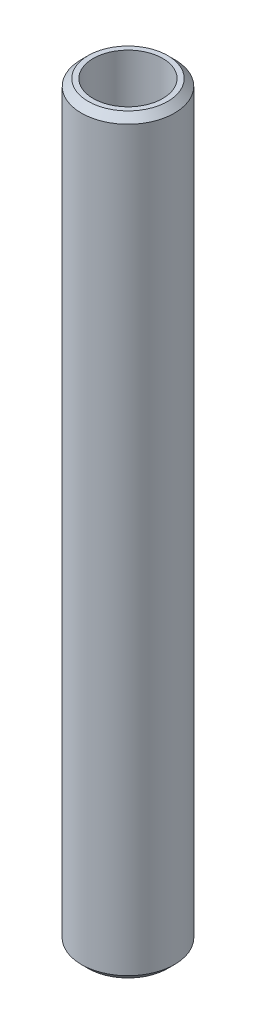
ISO-10303-21;
HEADER;
FILE_DESCRIPTION(('STEP AP214'),'2;1');
FILE_NAME('part.step','',(''),(''),'','','');
FILE_SCHEMA(('AUTOMOTIVE_DESIGN { 1 0 10303 214 1 1 1 1 }'));
ENDSEC;
DATA;
#1=APPLICATION_CONTEXT('core data for automotive mechanical design processes');
#2=APPLICATION_PROTOCOL_DEFINITION('international standard','automotive_design',2000,#1);
#3=PRODUCT_CONTEXT('',#1,'mechanical');
#4=PRODUCT('Part','Part','',(#3));
#5=PRODUCT_RELATED_PRODUCT_CATEGORY('part','',(#4));
#6=PRODUCT_DEFINITION_FORMATION('','',#4);
#7=PRODUCT_DEFINITION_CONTEXT('part definition',#1,'design');
#8=PRODUCT_DEFINITION('design','',#6,#7);
#9=PRODUCT_DEFINITION_SHAPE('','',#8);
#10=(LENGTH_UNIT() NAMED_UNIT(*) SI_UNIT(.MILLI.,.METRE.));
#11=(NAMED_UNIT(*) PLANE_ANGLE_UNIT() SI_UNIT($,.RADIAN.));
#12=(NAMED_UNIT(*) SI_UNIT($,.STERADIAN.) SOLID_ANGLE_UNIT());
#13=UNCERTAINTY_MEASURE_WITH_UNIT(LENGTH_MEASURE(1.E-05),#10,'distance_accuracy_value','');
#14=(GEOMETRIC_REPRESENTATION_CONTEXT(3) GLOBAL_UNCERTAINTY_ASSIGNED_CONTEXT((#13)) GLOBAL_UNIT_ASSIGNED_CONTEXT((#10,
#11,#12)) REPRESENTATION_CONTEXT('',''));
#15=CARTESIAN_POINT('',(0.,0.,0.));
#16=DIRECTION('',(0.,0.,1.));
#17=DIRECTION('',(1.,0.,0.));
#18=AXIS2_PLACEMENT_3D('',#15,#16,#17);
#19=CARTESIAN_POINT('',(0.,564.727513188879,0.));
#20=DIRECTION('',(0.,-1.,0.));
#21=DIRECTION('',(0.,0.,-1.));
#22=AXIS2_PLACEMENT_3D('',#19,#20,#21);
#23=CYLINDRICAL_SURFACE('',#22,35.);
#24=CARTESIAN_POINT('',(0.,559.636317334388,0.));
#25=DIRECTION('',(0.,1.,0.));
#26=DIRECTION('',(0.,0.,1.));
#27=AXIS2_PLACEMENT_3D('',#24,#25,#26);
#28=CIRCLE('',#27,35.);
#29=CARTESIAN_POINT('',(0.,559.636317334388,35.));
#30=VERTEX_POINT('',#29);
#31=EDGE_CURVE('E50',#30,#30,#28,.F.);
#32=ORIENTED_EDGE('',*,*,#31,.T.);
#33=EDGE_LOOP('',(#32));
#34=FACE_BOUND('',#33,.T.);
#35=CARTESIAN_POINT('',(0.,5.09119585449058,0.));
#36=DIRECTION('',(0.,1.,0.));
#37=DIRECTION('',(0.,0.,1.));
#38=AXIS2_PLACEMENT_3D('',#35,#36,#37);
#39=CIRCLE('',#38,35.);
#40=CARTESIAN_POINT('',(0.,5.09119585449058,35.));
#41=VERTEX_POINT('',#40);
#42=EDGE_CURVE('E51',#41,#41,#39,.T.);
#43=ORIENTED_EDGE('',*,*,#42,.T.);
#44=EDGE_LOOP('',(#43));
#45=FACE_BOUND('',#44,.T.);
#46=ADVANCED_FACE('F39',(#34,#45),#23,.T.);
#47=CARTESIAN_POINT('',(0.,564.727513188879,0.));
#48=DIRECTION('',(0.,1.,0.));
#49=DIRECTION('',(0.,0.,1.));
#50=AXIS2_PLACEMENT_3D('',#47,#48,#49);
#51=PLANE('',#50);
#52=CARTESIAN_POINT('',(0.,564.727513188879,0.));
#53=DIRECTION('',(0.,1.,0.));
#54=DIRECTION('',(0.,0.,1.));
#55=AXIS2_PLACEMENT_3D('',#52,#53,#54);
#56=CIRCLE('',#55,29.9088041455094);
#57=CARTESIAN_POINT('',(0.,564.727513188879,29.9088041455094));
#58=VERTEX_POINT('',#57);
#59=EDGE_CURVE('E54',#58,#58,#56,.T.);
#60=ORIENTED_EDGE('',*,*,#59,.T.);
#61=EDGE_LOOP('',(#60));
#62=FACE_BOUND('',#61,.T.);
#63=CARTESIAN_POINT('',(0.,564.727513188879,0.));
#64=DIRECTION('',(0.,1.,0.));
#65=DIRECTION('',(0.,0.,1.));
#66=AXIS2_PLACEMENT_3D('',#63,#64,#65);
#67=CIRCLE('',#66,26.1412418971941);
#68=CARTESIAN_POINT('',(0.,564.727513188879,26.1412418971941));
#69=VERTEX_POINT('',#68);
#70=EDGE_CURVE('E58',#69,#69,#67,.T.);
#71=ORIENTED_EDGE('',*,*,#70,.F.);
#72=EDGE_LOOP('',(#71));
#73=FACE_BOUND('',#72,.T.);
#74=ADVANCED_FACE('F69',(#62,#73),#51,.T.);
#75=CARTESIAN_POINT('',(0.,0.,0.));
#76=DIRECTION('',(0.,1.,0.));
#77=DIRECTION('',(0.,0.,1.));
#78=AXIS2_PLACEMENT_3D('',#75,#76,#77);
#79=PLANE('',#78);
#80=CARTESIAN_POINT('',(0.,0.,0.));
#81=DIRECTION('',(0.,1.,0.));
#82=DIRECTION('',(0.,0.,1.));
#83=AXIS2_PLACEMENT_3D('',#80,#81,#82);
#84=CIRCLE('',#83,29.9088041455094);
#85=CARTESIAN_POINT('',(0.,0.,29.9088041455094));
#86=VERTEX_POINT('',#85);
#87=EDGE_CURVE('E10',#86,#86,#84,.F.);
#88=ORIENTED_EDGE('',*,*,#87,.T.);
#89=EDGE_LOOP('',(#88));
#90=FACE_BOUND('',#89,.T.);
#91=CARTESIAN_POINT('',(0.,0.,0.));
#92=DIRECTION('',(0.,1.,0.));
#93=DIRECTION('',(0.,0.,1.));
#94=AXIS2_PLACEMENT_3D('',#91,#92,#93);
#95=CIRCLE('',#94,26.1412418971941);
#96=CARTESIAN_POINT('',(0.,0.,26.1412418971941));
#97=VERTEX_POINT('',#96);
#98=EDGE_CURVE('E63',#97,#97,#95,.T.);
#99=ORIENTED_EDGE('',*,*,#98,.T.);
#100=EDGE_LOOP('',(#99));
#101=FACE_BOUND('',#100,.T.);
#102=ADVANCED_FACE('F75',(#90,#101),#79,.F.);
#103=CARTESIAN_POINT('',(0.,564.727513188879,0.));
#104=DIRECTION('',(0.,-1.,0.));
#105=DIRECTION('',(0.,0.,-1.));
#106=AXIS2_PLACEMENT_3D('',#103,#104,#105);
#107=CYLINDRICAL_SURFACE('',#106,26.1412418971941);
#108=ORIENTED_EDGE('',*,*,#70,.T.);
#109=EDGE_LOOP('',(#108));
#110=FACE_BOUND('',#109,.T.);
#111=ORIENTED_EDGE('',*,*,#98,.F.);
#112=EDGE_LOOP('',(#111));
#113=FACE_BOUND('',#112,.T.);
#114=ADVANCED_FACE('F70',(#110,#113),#107,.F.);
#115=CARTESIAN_POINT('',(0.,564.727513188879,0.));
#116=DIRECTION('',(0.,-1.,0.));
#117=DIRECTION('',(0.,0.,-1.));
#118=AXIS2_PLACEMENT_3D('',#115,#116,#117);
#119=CONICAL_SURFACE('',#118,29.9088041455094,0.785398163397446);
#120=ORIENTED_EDGE('',*,*,#31,.F.);
#121=EDGE_LOOP('',(#120));
#122=FACE_BOUND('',#121,.T.);
#123=ORIENTED_EDGE('',*,*,#59,.F.);
#124=EDGE_LOOP('',(#123));
#125=FACE_BOUND('',#124,.T.);
#126=ADVANCED_FACE('F81',(#122,#125),#119,.T.);
#127=CARTESIAN_POINT('',(0.,5.09119585449058,0.));
#128=DIRECTION('',(0.,1.,0.));
#129=DIRECTION('',(0.,0.,1.));
#130=AXIS2_PLACEMENT_3D('',#127,#128,#129);
#131=CONICAL_SURFACE('',#130,35.,0.785398163397452);
#132=ORIENTED_EDGE('',*,*,#87,.F.);
#133=EDGE_LOOP('',(#132));
#134=FACE_BOUND('',#133,.T.);
#135=ORIENTED_EDGE('',*,*,#42,.F.);
#136=EDGE_LOOP('',(#135));
#137=FACE_BOUND('',#136,.T.);
#138=ADVANCED_FACE('F45',(#134,#137),#131,.T.);
#139=CLOSED_SHELL('',(#46,#74,#102,#114,#126,#138));
#140=MANIFOLD_SOLID_BREP('B2',#139);
#141=ADVANCED_BREP_SHAPE_REPRESENTATION('',(#18,#140),#14);
#142=SHAPE_DEFINITION_REPRESENTATION(#9,#141);
ENDSEC;
END-ISO-10303-21;
